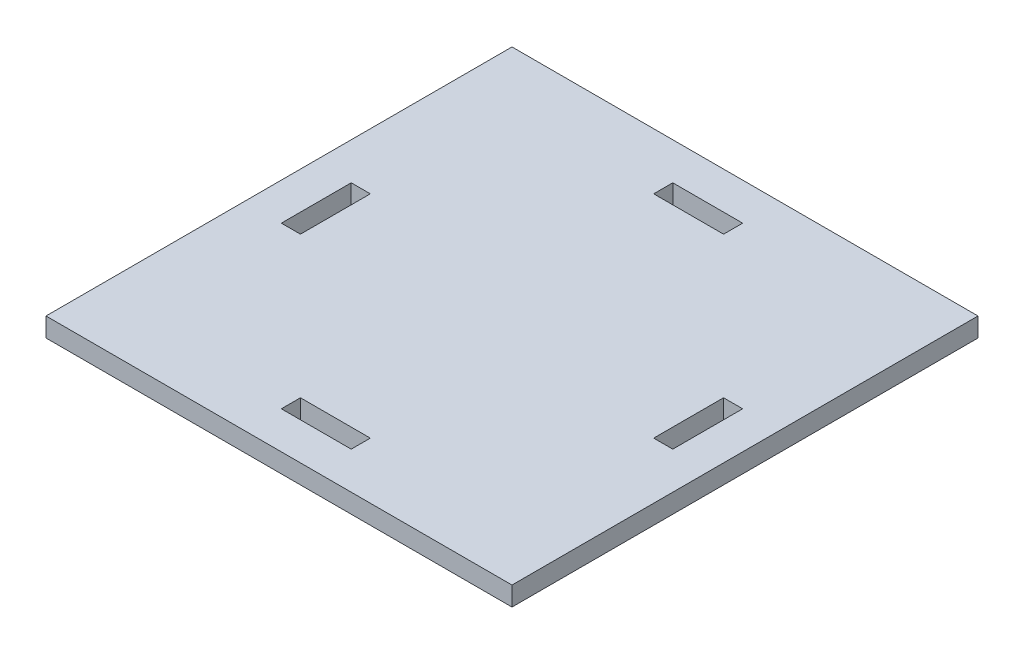
ISO-10303-21;
HEADER;
FILE_DESCRIPTION(('STEP AP214'),'2;1');
FILE_NAME('part.step','',(''),(''),'','','');
FILE_SCHEMA(('AUTOMOTIVE_DESIGN { 1 0 10303 214 1 1 1 1 }'));
ENDSEC;
DATA;
#1=APPLICATION_CONTEXT('core data for automotive mechanical design processes');
#2=APPLICATION_PROTOCOL_DEFINITION('international standard','automotive_design',2000,#1);
#3=PRODUCT_CONTEXT('',#1,'mechanical');
#4=PRODUCT('Part','Part','',(#3));
#5=PRODUCT_RELATED_PRODUCT_CATEGORY('part','',(#4));
#6=PRODUCT_DEFINITION_FORMATION('','',#4);
#7=PRODUCT_DEFINITION_CONTEXT('part definition',#1,'design');
#8=PRODUCT_DEFINITION('design','',#6,#7);
#9=PRODUCT_DEFINITION_SHAPE('','',#8);
#10=(LENGTH_UNIT() NAMED_UNIT(*) SI_UNIT(.MILLI.,.METRE.));
#11=(NAMED_UNIT(*) PLANE_ANGLE_UNIT() SI_UNIT($,.RADIAN.));
#12=(NAMED_UNIT(*) SI_UNIT($,.STERADIAN.) SOLID_ANGLE_UNIT());
#13=UNCERTAINTY_MEASURE_WITH_UNIT(LENGTH_MEASURE(1.E-05),#10,'distance_accuracy_value','');
#14=(GEOMETRIC_REPRESENTATION_CONTEXT(3) GLOBAL_UNCERTAINTY_ASSIGNED_CONTEXT((#13)) GLOBAL_UNIT_ASSIGNED_CONTEXT((#10,
#11,#12)) REPRESENTATION_CONTEXT('',''));
#15=CARTESIAN_POINT('',(0.,0.,0.));
#16=DIRECTION('',(0.,0.,1.));
#17=DIRECTION('',(1.,0.,0.));
#18=AXIS2_PLACEMENT_3D('',#15,#16,#17);
#19=CARTESIAN_POINT('',(0.,4.1,-100.));
#20=DIRECTION('',(0.,-1.,0.));
#21=DIRECTION('',(0.,0.,-1.));
#22=AXIS2_PLACEMENT_3D('',#19,#20,#21);
#23=PLANE('',#22);
#24=DIRECTION('',(0.,0.,1.));
#25=VECTOR('',#24,1.);
#26=CARTESIAN_POINT('',(8.00000000000003,4.1,-42.5));
#27=LINE('',#26,#25);
#28=CARTESIAN_POINT('',(8.00000000000002,4.1,-57.5));
#29=VERTEX_POINT('',#28);
#30=CARTESIAN_POINT('',(8.00000000000003,4.1,-42.5));
#31=VERTEX_POINT('',#30);
#32=EDGE_CURVE('E207',#29,#31,#27,.T.);
#33=ORIENTED_EDGE('',*,*,#32,.F.);
#34=DIRECTION('',(-1.,0.,0.));
#35=VECTOR('',#34,1.);
#36=CARTESIAN_POINT('',(8.00000000000002,4.1,-57.5));
#37=LINE('',#36,#35);
#38=CARTESIAN_POINT('',(12.1,4.1,-57.5));
#39=VERTEX_POINT('',#38);
#40=EDGE_CURVE('E215',#39,#29,#37,.T.);
#41=ORIENTED_EDGE('',*,*,#40,.F.);
#42=DIRECTION('',(0.,0.,-1.));
#43=VECTOR('',#42,1.);
#44=CARTESIAN_POINT('',(12.1,4.1,-42.5));
#45=LINE('',#44,#43);
#46=CARTESIAN_POINT('',(12.1,4.1,-42.5));
#47=VERTEX_POINT('',#46);
#48=EDGE_CURVE('E212',#47,#39,#45,.T.);
#49=ORIENTED_EDGE('',*,*,#48,.F.);
#50=DIRECTION('',(1.,0.,0.));
#51=VECTOR('',#50,1.);
#52=CARTESIAN_POINT('',(8.00000000000003,4.1,-42.5));
#53=LINE('',#52,#51);
#54=EDGE_CURVE('E209',#31,#47,#53,.T.);
#55=ORIENTED_EDGE('',*,*,#54,.F.);
#56=EDGE_LOOP('',(#33,#41,#49,#55));
#57=FACE_BOUND('',#56,.T.);
#58=DIRECTION('',(0.,0.,1.));
#59=VECTOR('',#58,1.);
#60=CARTESIAN_POINT('',(42.5,4.1,-92.));
#61=LINE('',#60,#59);
#62=CARTESIAN_POINT('',(42.5,4.1,-92.));
#63=VERTEX_POINT('',#62);
#64=CARTESIAN_POINT('',(42.5,4.1,-87.9));
#65=VERTEX_POINT('',#64);
#66=EDGE_CURVE('E269',#63,#65,#61,.T.);
#67=ORIENTED_EDGE('',*,*,#66,.F.);
#68=DIRECTION('',(-1.,0.,0.));
#69=VECTOR('',#68,1.);
#70=CARTESIAN_POINT('',(42.5,4.1,-92.));
#71=LINE('',#70,#69);
#72=CARTESIAN_POINT('',(57.5,4.1,-92.));
#73=VERTEX_POINT('',#72);
#74=EDGE_CURVE('E277',#73,#63,#71,.T.);
#75=ORIENTED_EDGE('',*,*,#74,.F.);
#76=DIRECTION('',(0.,0.,-1.));
#77=VECTOR('',#76,1.);
#78=CARTESIAN_POINT('',(57.5,4.1,-92.));
#79=LINE('',#78,#77);
#80=CARTESIAN_POINT('',(57.5,4.1,-87.9));
#81=VERTEX_POINT('',#80);
#82=EDGE_CURVE('E274',#81,#73,#79,.T.);
#83=ORIENTED_EDGE('',*,*,#82,.F.);
#84=DIRECTION('',(1.,0.,0.));
#85=VECTOR('',#84,1.);
#86=CARTESIAN_POINT('',(42.5,4.1,-87.9));
#87=LINE('',#86,#85);
#88=EDGE_CURVE('E271',#65,#81,#87,.T.);
#89=ORIENTED_EDGE('',*,*,#88,.F.);
#90=EDGE_LOOP('',(#67,#75,#83,#89));
#91=FACE_BOUND('',#90,.T.);
#92=DIRECTION('',(0.,0.,1.));
#93=VECTOR('',#92,1.);
#94=CARTESIAN_POINT('',(0.,4.1,0.));
#95=LINE('',#94,#93);
#96=CARTESIAN_POINT('',(0.,4.1,-100.));
#97=VERTEX_POINT('',#96);
#98=CARTESIAN_POINT('',(0.,4.1,0.));
#99=VERTEX_POINT('',#98);
#100=EDGE_CURVE('E300',#97,#99,#95,.T.);
#101=ORIENTED_EDGE('',*,*,#100,.T.);
#102=DIRECTION('',(1.,0.,0.));
#103=VECTOR('',#102,1.);
#104=CARTESIAN_POINT('',(0.,4.1,0.));
#105=LINE('',#104,#103);
#106=CARTESIAN_POINT('',(100.,4.1,0.));
#107=VERTEX_POINT('',#106);
#108=EDGE_CURVE('E303',#99,#107,#105,.T.);
#109=ORIENTED_EDGE('',*,*,#108,.T.);
#110=DIRECTION('',(0.,0.,-1.));
#111=VECTOR('',#110,1.);
#112=CARTESIAN_POINT('',(100.,4.1,0.));
#113=LINE('',#112,#111);
#114=CARTESIAN_POINT('',(100.,4.1,-100.));
#115=VERTEX_POINT('',#114);
#116=EDGE_CURVE('E306',#107,#115,#113,.T.);
#117=ORIENTED_EDGE('',*,*,#116,.T.);
#118=DIRECTION('',(-1.,0.,0.));
#119=VECTOR('',#118,1.);
#120=CARTESIAN_POINT('',(0.,4.1,-100.));
#121=LINE('',#120,#119);
#122=EDGE_CURVE('E308',#115,#97,#121,.T.);
#123=ORIENTED_EDGE('',*,*,#122,.T.);
#124=EDGE_LOOP('',(#101,#109,#117,#123));
#125=FACE_BOUND('',#124,.T.);
#126=DIRECTION('',(1.,0.,0.));
#127=VECTOR('',#126,1.);
#128=CARTESIAN_POINT('',(42.5,4.1,-8.00000000000004));
#129=LINE('',#128,#127);
#130=CARTESIAN_POINT('',(42.5,4.1,-8.00000000000004));
#131=VERTEX_POINT('',#130);
#132=CARTESIAN_POINT('',(57.5,4.1,-8.00000000000004));
#133=VERTEX_POINT('',#132);
#134=EDGE_CURVE('E238',#131,#133,#129,.T.);
#135=ORIENTED_EDGE('',*,*,#134,.F.);
#136=DIRECTION('',(0.,0.,1.));
#137=VECTOR('',#136,1.);
#138=CARTESIAN_POINT('',(42.5,4.1,-8.00000000000004));
#139=LINE('',#138,#137);
#140=CARTESIAN_POINT('',(42.5,4.1,-12.1));
#141=VERTEX_POINT('',#140);
#142=EDGE_CURVE('E246',#141,#131,#139,.T.);
#143=ORIENTED_EDGE('',*,*,#142,.F.);
#144=DIRECTION('',(-1.,0.,0.));
#145=VECTOR('',#144,1.);
#146=CARTESIAN_POINT('',(42.5,4.1,-12.1));
#147=LINE('',#146,#145);
#148=CARTESIAN_POINT('',(57.5,4.1,-12.1));
#149=VERTEX_POINT('',#148);
#150=EDGE_CURVE('E243',#149,#141,#147,.T.);
#151=ORIENTED_EDGE('',*,*,#150,.F.);
#152=DIRECTION('',(0.,0.,-1.));
#153=VECTOR('',#152,1.);
#154=CARTESIAN_POINT('',(57.5,4.1,-8.00000000000004));
#155=LINE('',#154,#153);
#156=EDGE_CURVE('E240',#133,#149,#155,.T.);
#157=ORIENTED_EDGE('',*,*,#156,.F.);
#158=EDGE_LOOP('',(#135,#143,#151,#157));
#159=FACE_BOUND('',#158,.T.);
#160=DIRECTION('',(0.,0.,-1.));
#161=VECTOR('',#160,1.);
#162=CARTESIAN_POINT('',(92.,4.1,-42.5));
#163=LINE('',#162,#161);
#164=CARTESIAN_POINT('',(92.,4.1,-42.5));
#165=VERTEX_POINT('',#164);
#166=CARTESIAN_POINT('',(91.9999999999999,4.1,-57.5));
#167=VERTEX_POINT('',#166);
#168=EDGE_CURVE('E171',#165,#167,#163,.T.);
#169=ORIENTED_EDGE('',*,*,#168,.F.);
#170=DIRECTION('',(1.,0.,0.));
#171=VECTOR('',#170,1.);
#172=CARTESIAN_POINT('',(92.,4.1,-42.5));
#173=LINE('',#172,#171);
#174=CARTESIAN_POINT('',(87.9,4.1,-42.5));
#175=VERTEX_POINT('',#174);
#176=EDGE_CURVE('E193',#175,#165,#173,.T.);
#177=ORIENTED_EDGE('',*,*,#176,.F.);
#178=DIRECTION('',(0.,0.,1.));
#179=VECTOR('',#178,1.);
#180=CARTESIAN_POINT('',(87.9,4.1,-42.5));
#181=LINE('',#180,#179);
#182=CARTESIAN_POINT('',(87.9,4.1,-57.5));
#183=VERTEX_POINT('',#182);
#184=EDGE_CURVE('E191',#183,#175,#181,.T.);
#185=ORIENTED_EDGE('',*,*,#184,.F.);
#186=DIRECTION('',(-1.,0.,0.));
#187=VECTOR('',#186,1.);
#188=CARTESIAN_POINT('',(91.9999999999999,4.1,-57.5));
#189=LINE('',#188,#187);
#190=EDGE_CURVE('E179',#167,#183,#189,.T.);
#191=ORIENTED_EDGE('',*,*,#190,.F.);
#192=EDGE_LOOP('',(#169,#177,#185,#191));
#193=FACE_BOUND('',#192,.T.);
#194=ADVANCED_FACE('F34',(#57,#91,#125,#159,#193),#23,.F.);
#195=CARTESIAN_POINT('',(0.,0.,-100.));
#196=DIRECTION('',(0.,-1.,0.));
#197=DIRECTION('',(0.,0.,-1.));
#198=AXIS2_PLACEMENT_3D('',#195,#196,#197);
#199=PLANE('',#198);
#200=DIRECTION('',(-1.,0.,0.));
#201=VECTOR('',#200,1.);
#202=CARTESIAN_POINT('',(8.00000000000002,0.,-57.5));
#203=LINE('',#202,#201);
#204=CARTESIAN_POINT('',(12.1,0.,-57.5));
#205=VERTEX_POINT('',#204);
#206=CARTESIAN_POINT('',(8.00000000000002,0.,-57.5));
#207=VERTEX_POINT('',#206);
#208=EDGE_CURVE('E210',#205,#207,#203,.T.);
#209=ORIENTED_EDGE('',*,*,#208,.T.);
#210=DIRECTION('',(0.,0.,1.));
#211=VECTOR('',#210,1.);
#212=CARTESIAN_POINT('',(8.00000000000003,0.,-42.5));
#213=LINE('',#212,#211);
#214=CARTESIAN_POINT('',(8.00000000000003,0.,-42.5));
#215=VERTEX_POINT('',#214);
#216=EDGE_CURVE('E187',#207,#215,#213,.T.);
#217=ORIENTED_EDGE('',*,*,#216,.T.);
#218=DIRECTION('',(1.,0.,0.));
#219=VECTOR('',#218,1.);
#220=CARTESIAN_POINT('',(8.00000000000003,0.,-42.5));
#221=LINE('',#220,#219);
#222=CARTESIAN_POINT('',(12.1,0.,-42.5));
#223=VERTEX_POINT('',#222);
#224=EDGE_CURVE('E220',#215,#223,#221,.T.);
#225=ORIENTED_EDGE('',*,*,#224,.T.);
#226=DIRECTION('',(0.,0.,-1.));
#227=VECTOR('',#226,1.);
#228=CARTESIAN_POINT('',(12.1,0.,-42.5));
#229=LINE('',#228,#227);
#230=EDGE_CURVE('E223',#223,#205,#229,.T.);
#231=ORIENTED_EDGE('',*,*,#230,.T.);
#232=EDGE_LOOP('',(#209,#217,#225,#231));
#233=FACE_BOUND('',#232,.T.);
#234=DIRECTION('',(-1.,0.,0.));
#235=VECTOR('',#234,1.);
#236=CARTESIAN_POINT('',(42.5,0.,-92.));
#237=LINE('',#236,#235);
#238=CARTESIAN_POINT('',(57.5,0.,-92.));
#239=VERTEX_POINT('',#238);
#240=CARTESIAN_POINT('',(42.5,0.,-92.));
#241=VERTEX_POINT('',#240);
#242=EDGE_CURVE('E272',#239,#241,#237,.T.);
#243=ORIENTED_EDGE('',*,*,#242,.T.);
#244=DIRECTION('',(0.,0.,1.));
#245=VECTOR('',#244,1.);
#246=CARTESIAN_POINT('',(42.5,0.,-92.));
#247=LINE('',#246,#245);
#248=CARTESIAN_POINT('',(42.5,0.,-87.9));
#249=VERTEX_POINT('',#248);
#250=EDGE_CURVE('E268',#241,#249,#247,.T.);
#251=ORIENTED_EDGE('',*,*,#250,.T.);
#252=DIRECTION('',(1.,0.,0.));
#253=VECTOR('',#252,1.);
#254=CARTESIAN_POINT('',(42.5,0.,-87.9));
#255=LINE('',#254,#253);
#256=CARTESIAN_POINT('',(57.5,0.,-87.9));
#257=VERTEX_POINT('',#256);
#258=EDGE_CURVE('E282',#249,#257,#255,.T.);
#259=ORIENTED_EDGE('',*,*,#258,.T.);
#260=DIRECTION('',(0.,0.,-1.));
#261=VECTOR('',#260,1.);
#262=CARTESIAN_POINT('',(57.5,0.,-92.));
#263=LINE('',#262,#261);
#264=EDGE_CURVE('E285',#257,#239,#263,.T.);
#265=ORIENTED_EDGE('',*,*,#264,.T.);
#266=EDGE_LOOP('',(#243,#251,#259,#265));
#267=FACE_BOUND('',#266,.T.);
#268=DIRECTION('',(0.,0.,1.));
#269=VECTOR('',#268,1.);
#270=CARTESIAN_POINT('',(0.,0.,0.));
#271=LINE('',#270,#269);
#272=CARTESIAN_POINT('',(0.,0.,-100.));
#273=VERTEX_POINT('',#272);
#274=CARTESIAN_POINT('',(0.,0.,0.));
#275=VERTEX_POINT('',#274);
#276=EDGE_CURVE('E299',#273,#275,#271,.T.);
#277=ORIENTED_EDGE('',*,*,#276,.F.);
#278=DIRECTION('',(-1.,0.,0.));
#279=VECTOR('',#278,1.);
#280=CARTESIAN_POINT('',(0.,0.,-100.));
#281=LINE('',#280,#279);
#282=CARTESIAN_POINT('',(100.,0.,-100.));
#283=VERTEX_POINT('',#282);
#284=EDGE_CURVE('E304',#283,#273,#281,.T.);
#285=ORIENTED_EDGE('',*,*,#284,.F.);
#286=DIRECTION('',(0.,0.,-1.));
#287=VECTOR('',#286,1.);
#288=CARTESIAN_POINT('',(100.,0.,0.));
#289=LINE('',#288,#287);
#290=CARTESIAN_POINT('',(100.,0.,0.));
#291=VERTEX_POINT('',#290);
#292=EDGE_CURVE('E315',#291,#283,#289,.T.);
#293=ORIENTED_EDGE('',*,*,#292,.F.);
#294=DIRECTION('',(1.,0.,0.));
#295=VECTOR('',#294,1.);
#296=CARTESIAN_POINT('',(0.,0.,0.));
#297=LINE('',#296,#295);
#298=EDGE_CURVE('E313',#275,#291,#297,.T.);
#299=ORIENTED_EDGE('',*,*,#298,.F.);
#300=EDGE_LOOP('',(#277,#285,#293,#299));
#301=FACE_BOUND('',#300,.T.);
#302=DIRECTION('',(0.,0.,1.));
#303=VECTOR('',#302,1.);
#304=CARTESIAN_POINT('',(42.5,0.,-8.00000000000004));
#305=LINE('',#304,#303);
#306=CARTESIAN_POINT('',(42.5,0.,-12.1));
#307=VERTEX_POINT('',#306);
#308=CARTESIAN_POINT('',(42.5,0.,-8.00000000000004));
#309=VERTEX_POINT('',#308);
#310=EDGE_CURVE('E241',#307,#309,#305,.T.);
#311=ORIENTED_EDGE('',*,*,#310,.T.);
#312=DIRECTION('',(1.,0.,0.));
#313=VECTOR('',#312,1.);
#314=CARTESIAN_POINT('',(42.5,0.,-8.00000000000004));
#315=LINE('',#314,#313);
#316=CARTESIAN_POINT('',(57.5,0.,-8.00000000000004));
#317=VERTEX_POINT('',#316);
#318=EDGE_CURVE('E237',#309,#317,#315,.T.);
#319=ORIENTED_EDGE('',*,*,#318,.T.);
#320=DIRECTION('',(0.,0.,-1.));
#321=VECTOR('',#320,1.);
#322=CARTESIAN_POINT('',(57.5,0.,-8.00000000000004));
#323=LINE('',#322,#321);
#324=CARTESIAN_POINT('',(57.5,0.,-12.1));
#325=VERTEX_POINT('',#324);
#326=EDGE_CURVE('E251',#317,#325,#323,.T.);
#327=ORIENTED_EDGE('',*,*,#326,.T.);
#328=DIRECTION('',(-1.,0.,0.));
#329=VECTOR('',#328,1.);
#330=CARTESIAN_POINT('',(42.5,0.,-12.1));
#331=LINE('',#330,#329);
#332=EDGE_CURVE('E254',#325,#307,#331,.T.);
#333=ORIENTED_EDGE('',*,*,#332,.T.);
#334=EDGE_LOOP('',(#311,#319,#327,#333));
#335=FACE_BOUND('',#334,.T.);
#336=DIRECTION('',(1.,0.,0.));
#337=VECTOR('',#336,1.);
#338=CARTESIAN_POINT('',(92.,0.,-42.5));
#339=LINE('',#338,#337);
#340=CARTESIAN_POINT('',(87.9,0.,-42.5));
#341=VERTEX_POINT('',#340);
#342=CARTESIAN_POINT('',(92.,0.,-42.5));
#343=VERTEX_POINT('',#342);
#344=EDGE_CURVE('E180',#341,#343,#339,.T.);
#345=ORIENTED_EDGE('',*,*,#344,.T.);
#346=DIRECTION('',(0.,0.,-1.));
#347=VECTOR('',#346,1.);
#348=CARTESIAN_POINT('',(92.,0.,-42.5));
#349=LINE('',#348,#347);
#350=CARTESIAN_POINT('',(91.9999999999999,0.,-57.5));
#351=VERTEX_POINT('',#350);
#352=EDGE_CURVE('E57',#343,#351,#349,.T.);
#353=ORIENTED_EDGE('',*,*,#352,.T.);
#354=DIRECTION('',(-1.,0.,0.));
#355=VECTOR('',#354,1.);
#356=CARTESIAN_POINT('',(91.9999999999999,0.,-57.5));
#357=LINE('',#356,#355);
#358=CARTESIAN_POINT('',(87.9,0.,-57.5));
#359=VERTEX_POINT('',#358);
#360=EDGE_CURVE('E186',#351,#359,#357,.T.);
#361=ORIENTED_EDGE('',*,*,#360,.T.);
#362=DIRECTION('',(0.,0.,1.));
#363=VECTOR('',#362,1.);
#364=CARTESIAN_POINT('',(87.9,0.,-42.5));
#365=LINE('',#364,#363);
#366=EDGE_CURVE('E199',#359,#341,#365,.T.);
#367=ORIENTED_EDGE('',*,*,#366,.T.);
#368=EDGE_LOOP('',(#345,#353,#361,#367));
#369=FACE_BOUND('',#368,.T.);
#370=ADVANCED_FACE('F333',(#233,#267,#301,#335,#369),#199,.T.);
#371=CARTESIAN_POINT('',(0.,4.1,0.));
#372=DIRECTION('',(1.,0.,0.));
#373=DIRECTION('',(0.,0.,-1.));
#374=AXIS2_PLACEMENT_3D('',#371,#372,#373);
#375=PLANE('',#374);
#376=ORIENTED_EDGE('',*,*,#276,.T.);
#377=DIRECTION('',(0.,-1.,0.));
#378=VECTOR('',#377,1.);
#379=CARTESIAN_POINT('',(0.,4.1,0.));
#380=LINE('',#379,#378);
#381=EDGE_CURVE('E11',#99,#275,#380,.T.);
#382=ORIENTED_EDGE('',*,*,#381,.F.);
#383=ORIENTED_EDGE('',*,*,#100,.F.);
#384=DIRECTION('',(0.,-1.,0.));
#385=VECTOR('',#384,1.);
#386=CARTESIAN_POINT('',(0.,4.1,-100.));
#387=LINE('',#386,#385);
#388=EDGE_CURVE('E310',#97,#273,#387,.T.);
#389=ORIENTED_EDGE('',*,*,#388,.T.);
#390=EDGE_LOOP('',(#376,#382,#383,#389));
#391=FACE_BOUND('',#390,.T.);
#392=ADVANCED_FACE('F36',(#391),#375,.F.);
#393=CARTESIAN_POINT('',(0.,4.1,0.));
#394=DIRECTION('',(0.,0.,-1.));
#395=DIRECTION('',(-1.,0.,0.));
#396=AXIS2_PLACEMENT_3D('',#393,#394,#395);
#397=PLANE('',#396);
#398=ORIENTED_EDGE('',*,*,#298,.T.);
#399=DIRECTION('',(0.,-1.,0.));
#400=VECTOR('',#399,1.);
#401=CARTESIAN_POINT('',(100.,4.1,0.));
#402=LINE('',#401,#400);
#403=EDGE_CURVE('E42',#107,#291,#402,.T.);
#404=ORIENTED_EDGE('',*,*,#403,.F.);
#405=ORIENTED_EDGE('',*,*,#108,.F.);
#406=ORIENTED_EDGE('',*,*,#381,.T.);
#407=EDGE_LOOP('',(#398,#404,#405,#406));
#408=FACE_BOUND('',#407,.T.);
#409=ADVANCED_FACE('F344',(#408),#397,.F.);
#410=CARTESIAN_POINT('',(100.,4.1,0.));
#411=DIRECTION('',(-1.,0.,0.));
#412=DIRECTION('',(0.,0.,1.));
#413=AXIS2_PLACEMENT_3D('',#410,#411,#412);
#414=PLANE('',#413);
#415=ORIENTED_EDGE('',*,*,#292,.T.);
#416=DIRECTION('',(0.,-1.,0.));
#417=VECTOR('',#416,1.);
#418=CARTESIAN_POINT('',(100.,4.1,-100.));
#419=LINE('',#418,#417);
#420=EDGE_CURVE('E320',#115,#283,#419,.T.);
#421=ORIENTED_EDGE('',*,*,#420,.F.);
#422=ORIENTED_EDGE('',*,*,#116,.F.);
#423=ORIENTED_EDGE('',*,*,#403,.T.);
#424=EDGE_LOOP('',(#415,#421,#422,#423));
#425=FACE_BOUND('',#424,.T.);
#426=ADVANCED_FACE('F327',(#425),#414,.F.);
#427=CARTESIAN_POINT('',(0.,4.1,-100.));
#428=DIRECTION('',(0.,0.,1.));
#429=DIRECTION('',(1.,0.,0.));
#430=AXIS2_PLACEMENT_3D('',#427,#428,#429);
#431=PLANE('',#430);
#432=ORIENTED_EDGE('',*,*,#284,.T.);
#433=ORIENTED_EDGE('',*,*,#388,.F.);
#434=ORIENTED_EDGE('',*,*,#122,.F.);
#435=ORIENTED_EDGE('',*,*,#420,.T.);
#436=EDGE_LOOP('',(#432,#433,#434,#435));
#437=FACE_BOUND('',#436,.T.);
#438=ADVANCED_FACE('F337',(#437),#431,.F.);
#439=CARTESIAN_POINT('',(42.5,4.1,-92.));
#440=DIRECTION('',(1.,0.,0.));
#441=DIRECTION('',(0.,0.,-1.));
#442=AXIS2_PLACEMENT_3D('',#439,#440,#441);
#443=PLANE('',#442);
#444=ORIENTED_EDGE('',*,*,#250,.F.);
#445=DIRECTION('',(0.,-1.,0.));
#446=VECTOR('',#445,1.);
#447=CARTESIAN_POINT('',(42.5,4.1,-92.));
#448=LINE('',#447,#446);
#449=EDGE_CURVE('E279',#63,#241,#448,.T.);
#450=ORIENTED_EDGE('',*,*,#449,.F.);
#451=ORIENTED_EDGE('',*,*,#66,.T.);
#452=DIRECTION('',(0.,-1.,0.));
#453=VECTOR('',#452,1.);
#454=CARTESIAN_POINT('',(42.5,4.1,-87.9));
#455=LINE('',#454,#453);
#456=EDGE_CURVE('E296',#65,#249,#455,.T.);
#457=ORIENTED_EDGE('',*,*,#456,.T.);
#458=EDGE_LOOP('',(#444,#450,#451,#457));
#459=FACE_BOUND('',#458,.T.);
#460=ADVANCED_FACE('F362',(#459),#443,.T.);
#461=CARTESIAN_POINT('',(42.5,4.1,-87.9));
#462=DIRECTION('',(0.,0.,-1.));
#463=DIRECTION('',(-1.,0.,0.));
#464=AXIS2_PLACEMENT_3D('',#461,#462,#463);
#465=PLANE('',#464);
#466=ORIENTED_EDGE('',*,*,#258,.F.);
#467=ORIENTED_EDGE('',*,*,#456,.F.);
#468=ORIENTED_EDGE('',*,*,#88,.T.);
#469=DIRECTION('',(0.,-1.,0.));
#470=VECTOR('',#469,1.);
#471=CARTESIAN_POINT('',(57.5,4.1,-87.9));
#472=LINE('',#471,#470);
#473=EDGE_CURVE('E294',#81,#257,#472,.T.);
#474=ORIENTED_EDGE('',*,*,#473,.T.);
#475=EDGE_LOOP('',(#466,#467,#468,#474));
#476=FACE_BOUND('',#475,.T.);
#477=ADVANCED_FACE('F369',(#476),#465,.T.);
#478=CARTESIAN_POINT('',(57.5,4.1,-92.));
#479=DIRECTION('',(-1.,0.,0.));
#480=DIRECTION('',(0.,0.,1.));
#481=AXIS2_PLACEMENT_3D('',#478,#479,#480);
#482=PLANE('',#481);
#483=ORIENTED_EDGE('',*,*,#264,.F.);
#484=ORIENTED_EDGE('',*,*,#473,.F.);
#485=ORIENTED_EDGE('',*,*,#82,.T.);
#486=DIRECTION('',(0.,-1.,0.));
#487=VECTOR('',#486,1.);
#488=CARTESIAN_POINT('',(57.5,4.1,-92.));
#489=LINE('',#488,#487);
#490=EDGE_CURVE('E292',#73,#239,#489,.T.);
#491=ORIENTED_EDGE('',*,*,#490,.T.);
#492=EDGE_LOOP('',(#483,#484,#485,#491));
#493=FACE_BOUND('',#492,.T.);
#494=ADVANCED_FACE('F374',(#493),#482,.T.);
#495=CARTESIAN_POINT('',(42.5,4.1,-92.));
#496=DIRECTION('',(0.,0.,1.));
#497=DIRECTION('',(1.,0.,0.));
#498=AXIS2_PLACEMENT_3D('',#495,#496,#497);
#499=PLANE('',#498);
#500=ORIENTED_EDGE('',*,*,#242,.F.);
#501=ORIENTED_EDGE('',*,*,#490,.F.);
#502=ORIENTED_EDGE('',*,*,#74,.T.);
#503=ORIENTED_EDGE('',*,*,#449,.T.);
#504=EDGE_LOOP('',(#500,#501,#502,#503));
#505=FACE_BOUND('',#504,.T.);
#506=ADVANCED_FACE('F382',(#505),#499,.T.);
#507=CARTESIAN_POINT('',(42.5,4.1,-8.00000000000004));
#508=DIRECTION('',(0.,0.,-1.));
#509=DIRECTION('',(-1.,0.,0.));
#510=AXIS2_PLACEMENT_3D('',#507,#508,#509);
#511=PLANE('',#510);
#512=ORIENTED_EDGE('',*,*,#318,.F.);
#513=DIRECTION('',(0.,-1.,0.));
#514=VECTOR('',#513,1.);
#515=CARTESIAN_POINT('',(42.5,4.1,-8.00000000000004));
#516=LINE('',#515,#514);
#517=EDGE_CURVE('E248',#131,#309,#516,.T.);
#518=ORIENTED_EDGE('',*,*,#517,.F.);
#519=ORIENTED_EDGE('',*,*,#134,.T.);
#520=DIRECTION('',(0.,-1.,0.));
#521=VECTOR('',#520,1.);
#522=CARTESIAN_POINT('',(57.5,4.1,-8.00000000000004));
#523=LINE('',#522,#521);
#524=EDGE_CURVE('E265',#133,#317,#523,.T.);
#525=ORIENTED_EDGE('',*,*,#524,.T.);
#526=EDGE_LOOP('',(#512,#518,#519,#525));
#527=FACE_BOUND('',#526,.T.);
#528=ADVANCED_FACE('F394',(#527),#511,.T.);
#529=CARTESIAN_POINT('',(57.5,4.1,-8.00000000000004));
#530=DIRECTION('',(-1.,0.,0.));
#531=DIRECTION('',(0.,0.,1.));
#532=AXIS2_PLACEMENT_3D('',#529,#530,#531);
#533=PLANE('',#532);
#534=ORIENTED_EDGE('',*,*,#326,.F.);
#535=ORIENTED_EDGE('',*,*,#524,.F.);
#536=ORIENTED_EDGE('',*,*,#156,.T.);
#537=DIRECTION('',(0.,-1.,0.));
#538=VECTOR('',#537,1.);
#539=CARTESIAN_POINT('',(57.5,4.1,-12.1));
#540=LINE('',#539,#538);
#541=EDGE_CURVE('E263',#149,#325,#540,.T.);
#542=ORIENTED_EDGE('',*,*,#541,.T.);
#543=EDGE_LOOP('',(#534,#535,#536,#542));
#544=FACE_BOUND('',#543,.T.);
#545=ADVANCED_FACE('F399',(#544),#533,.T.);
#546=CARTESIAN_POINT('',(42.5,4.1,-12.1));
#547=DIRECTION('',(0.,0.,1.));
#548=DIRECTION('',(1.,0.,0.));
#549=AXIS2_PLACEMENT_3D('',#546,#547,#548);
#550=PLANE('',#549);
#551=ORIENTED_EDGE('',*,*,#332,.F.);
#552=ORIENTED_EDGE('',*,*,#541,.F.);
#553=ORIENTED_EDGE('',*,*,#150,.T.);
#554=DIRECTION('',(0.,-1.,0.));
#555=VECTOR('',#554,1.);
#556=CARTESIAN_POINT('',(42.5,4.1,-12.1));
#557=LINE('',#556,#555);
#558=EDGE_CURVE('E261',#141,#307,#557,.T.);
#559=ORIENTED_EDGE('',*,*,#558,.T.);
#560=EDGE_LOOP('',(#551,#552,#553,#559));
#561=FACE_BOUND('',#560,.T.);
#562=ADVANCED_FACE('F403',(#561),#550,.T.);
#563=CARTESIAN_POINT('',(42.5,4.1,-8.00000000000004));
#564=DIRECTION('',(1.,0.,0.));
#565=DIRECTION('',(0.,0.,-1.));
#566=AXIS2_PLACEMENT_3D('',#563,#564,#565);
#567=PLANE('',#566);
#568=ORIENTED_EDGE('',*,*,#310,.F.);
#569=ORIENTED_EDGE('',*,*,#558,.F.);
#570=ORIENTED_EDGE('',*,*,#142,.T.);
#571=ORIENTED_EDGE('',*,*,#517,.T.);
#572=EDGE_LOOP('',(#568,#569,#570,#571));
#573=FACE_BOUND('',#572,.T.);
#574=ADVANCED_FACE('F407',(#573),#567,.T.);
#575=CARTESIAN_POINT('',(8.00000000000003,4.1,-42.5));
#576=DIRECTION('',(1.,0.,0.));
#577=DIRECTION('',(0.,0.,-1.));
#578=AXIS2_PLACEMENT_3D('',#575,#576,#577);
#579=PLANE('',#578);
#580=ORIENTED_EDGE('',*,*,#216,.F.);
#581=DIRECTION('',(0.,-1.,0.));
#582=VECTOR('',#581,1.);
#583=CARTESIAN_POINT('',(8.00000000000002,4.1,-57.5));
#584=LINE('',#583,#582);
#585=EDGE_CURVE('E217',#29,#207,#584,.T.);
#586=ORIENTED_EDGE('',*,*,#585,.F.);
#587=ORIENTED_EDGE('',*,*,#32,.T.);
#588=DIRECTION('',(0.,-1.,0.));
#589=VECTOR('',#588,1.);
#590=CARTESIAN_POINT('',(8.00000000000003,4.1,-42.5));
#591=LINE('',#590,#589);
#592=EDGE_CURVE('E234',#31,#215,#591,.T.);
#593=ORIENTED_EDGE('',*,*,#592,.T.);
#594=EDGE_LOOP('',(#580,#586,#587,#593));
#595=FACE_BOUND('',#594,.T.);
#596=ADVANCED_FACE('F411',(#595),#579,.T.);
#597=CARTESIAN_POINT('',(8.00000000000003,4.1,-42.5));
#598=DIRECTION('',(0.,0.,-1.));
#599=DIRECTION('',(-1.,0.,0.));
#600=AXIS2_PLACEMENT_3D('',#597,#598,#599);
#601=PLANE('',#600);
#602=ORIENTED_EDGE('',*,*,#224,.F.);
#603=ORIENTED_EDGE('',*,*,#592,.F.);
#604=ORIENTED_EDGE('',*,*,#54,.T.);
#605=DIRECTION('',(0.,-1.,0.));
#606=VECTOR('',#605,1.);
#607=CARTESIAN_POINT('',(12.1,4.1,-42.5));
#608=LINE('',#607,#606);
#609=EDGE_CURVE('E232',#47,#223,#608,.T.);
#610=ORIENTED_EDGE('',*,*,#609,.T.);
#611=EDGE_LOOP('',(#602,#603,#604,#610));
#612=FACE_BOUND('',#611,.T.);
#613=ADVANCED_FACE('F415',(#612),#601,.T.);
#614=CARTESIAN_POINT('',(12.1,4.1,-42.5));
#615=DIRECTION('',(-1.,0.,0.));
#616=DIRECTION('',(0.,0.,1.));
#617=AXIS2_PLACEMENT_3D('',#614,#615,#616);
#618=PLANE('',#617);
#619=ORIENTED_EDGE('',*,*,#230,.F.);
#620=ORIENTED_EDGE('',*,*,#609,.F.);
#621=ORIENTED_EDGE('',*,*,#48,.T.);
#622=DIRECTION('',(0.,-1.,0.));
#623=VECTOR('',#622,1.);
#624=CARTESIAN_POINT('',(12.1,4.1,-57.5));
#625=LINE('',#624,#623);
#626=EDGE_CURVE('E230',#39,#205,#625,.T.);
#627=ORIENTED_EDGE('',*,*,#626,.T.);
#628=EDGE_LOOP('',(#619,#620,#621,#627));
#629=FACE_BOUND('',#628,.T.);
#630=ADVANCED_FACE('F419',(#629),#618,.T.);
#631=CARTESIAN_POINT('',(8.00000000000002,4.1,-57.5));
#632=DIRECTION('',(0.,0.,1.));
#633=DIRECTION('',(1.,0.,0.));
#634=AXIS2_PLACEMENT_3D('',#631,#632,#633);
#635=PLANE('',#634);
#636=ORIENTED_EDGE('',*,*,#208,.F.);
#637=ORIENTED_EDGE('',*,*,#626,.F.);
#638=ORIENTED_EDGE('',*,*,#40,.T.);
#639=ORIENTED_EDGE('',*,*,#585,.T.);
#640=EDGE_LOOP('',(#636,#637,#638,#639));
#641=FACE_BOUND('',#640,.T.);
#642=ADVANCED_FACE('F423',(#641),#635,.T.);
#643=CARTESIAN_POINT('',(92.,4.1,-42.5));
#644=DIRECTION('',(-1.,0.,0.));
#645=DIRECTION('',(0.,0.,1.));
#646=AXIS2_PLACEMENT_3D('',#643,#644,#645);
#647=PLANE('',#646);
#648=ORIENTED_EDGE('',*,*,#352,.F.);
#649=DIRECTION('',(0.,-1.,0.));
#650=VECTOR('',#649,1.);
#651=CARTESIAN_POINT('',(92.,4.1,-42.5));
#652=LINE('',#651,#650);
#653=EDGE_CURVE('E175',#165,#343,#652,.T.);
#654=ORIENTED_EDGE('',*,*,#653,.F.);
#655=ORIENTED_EDGE('',*,*,#168,.T.);
#656=DIRECTION('',(0.,-1.,0.));
#657=VECTOR('',#656,1.);
#658=CARTESIAN_POINT('',(91.9999999999999,4.1,-57.5));
#659=LINE('',#658,#657);
#660=EDGE_CURVE('E174',#167,#351,#659,.T.);
#661=ORIENTED_EDGE('',*,*,#660,.T.);
#662=EDGE_LOOP('',(#648,#654,#655,#661));
#663=FACE_BOUND('',#662,.T.);
#664=ADVANCED_FACE('F173',(#663),#647,.T.);
#665=CARTESIAN_POINT('',(91.9999999999999,4.1,-57.5));
#666=DIRECTION('',(0.,0.,1.));
#667=DIRECTION('',(1.,0.,0.));
#668=AXIS2_PLACEMENT_3D('',#665,#666,#667);
#669=PLANE('',#668);
#670=ORIENTED_EDGE('',*,*,#360,.F.);
#671=ORIENTED_EDGE('',*,*,#660,.F.);
#672=ORIENTED_EDGE('',*,*,#190,.T.);
#673=DIRECTION('',(0.,-1.,0.));
#674=VECTOR('',#673,1.);
#675=CARTESIAN_POINT('',(87.9,4.1,-57.5));
#676=LINE('',#675,#674);
#677=EDGE_CURVE('E188',#183,#359,#676,.T.);
#678=ORIENTED_EDGE('',*,*,#677,.T.);
#679=EDGE_LOOP('',(#670,#671,#672,#678));
#680=FACE_BOUND('',#679,.T.);
#681=ADVANCED_FACE('F183',(#680),#669,.T.);
#682=CARTESIAN_POINT('',(87.9,4.1,-42.5));
#683=DIRECTION('',(1.,0.,0.));
#684=DIRECTION('',(0.,0.,-1.));
#685=AXIS2_PLACEMENT_3D('',#682,#683,#684);
#686=PLANE('',#685);
#687=ORIENTED_EDGE('',*,*,#366,.F.);
#688=ORIENTED_EDGE('',*,*,#677,.F.);
#689=ORIENTED_EDGE('',*,*,#184,.T.);
#690=DIRECTION('',(0.,-1.,0.));
#691=VECTOR('',#690,1.);
#692=CARTESIAN_POINT('',(87.9,4.1,-42.5));
#693=LINE('',#692,#691);
#694=EDGE_CURVE('E49',#175,#341,#693,.T.);
#695=ORIENTED_EDGE('',*,*,#694,.T.);
#696=EDGE_LOOP('',(#687,#688,#689,#695));
#697=FACE_BOUND('',#696,.T.);
#698=ADVANCED_FACE('F432',(#697),#686,.T.);
#699=CARTESIAN_POINT('',(92.,4.1,-42.5));
#700=DIRECTION('',(0.,0.,-1.));
#701=DIRECTION('',(-1.,0.,0.));
#702=AXIS2_PLACEMENT_3D('',#699,#700,#701);
#703=PLANE('',#702);
#704=ORIENTED_EDGE('',*,*,#344,.F.);
#705=ORIENTED_EDGE('',*,*,#694,.F.);
#706=ORIENTED_EDGE('',*,*,#176,.T.);
#707=ORIENTED_EDGE('',*,*,#653,.T.);
#708=EDGE_LOOP('',(#704,#705,#706,#707));
#709=FACE_BOUND('',#708,.T.);
#710=ADVANCED_FACE('F435',(#709),#703,.T.);
#711=CLOSED_SHELL('',(#194,#370,#392,#409,#426,#438,#460,#477,#494,#506,#528,#545,#562,#574,
#596,#613,#630,#642,#664,#681,#698,#710));
#712=MANIFOLD_SOLID_BREP('B2',#711);
#713=ADVANCED_BREP_SHAPE_REPRESENTATION('',(#18,#712),#14);
#714=SHAPE_DEFINITION_REPRESENTATION(#9,#713);
ENDSEC;
END-ISO-10303-21;
